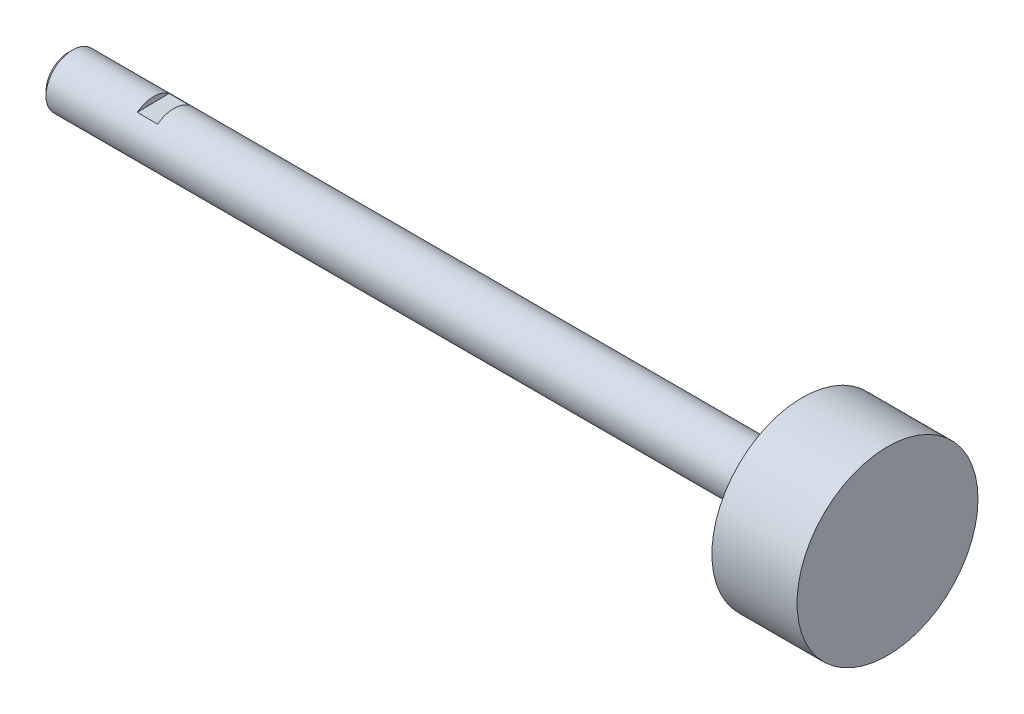
ISO-10303-21;
HEADER;
FILE_DESCRIPTION(('STEP AP214'),'2;1');
FILE_NAME('part.step','',(''),(''),'','','');
FILE_SCHEMA(('AUTOMOTIVE_DESIGN { 1 0 10303 214 1 1 1 1 }'));
ENDSEC;
DATA;
#1=APPLICATION_CONTEXT('core data for automotive mechanical design processes');
#2=APPLICATION_PROTOCOL_DEFINITION('international standard','automotive_design',2000,#1);
#3=PRODUCT_CONTEXT('',#1,'mechanical');
#4=PRODUCT('Part','Part','',(#3));
#5=PRODUCT_RELATED_PRODUCT_CATEGORY('part','',(#4));
#6=PRODUCT_DEFINITION_FORMATION('','',#4);
#7=PRODUCT_DEFINITION_CONTEXT('part definition',#1,'design');
#8=PRODUCT_DEFINITION('design','',#6,#7);
#9=PRODUCT_DEFINITION_SHAPE('','',#8);
#10=(LENGTH_UNIT() NAMED_UNIT(*) SI_UNIT(.MILLI.,.METRE.));
#11=(NAMED_UNIT(*) PLANE_ANGLE_UNIT() SI_UNIT($,.RADIAN.));
#12=(NAMED_UNIT(*) SI_UNIT($,.STERADIAN.) SOLID_ANGLE_UNIT());
#13=UNCERTAINTY_MEASURE_WITH_UNIT(LENGTH_MEASURE(1.E-05),#10,'distance_accuracy_value','');
#14=(GEOMETRIC_REPRESENTATION_CONTEXT(3) GLOBAL_UNCERTAINTY_ASSIGNED_CONTEXT((#13)) GLOBAL_UNIT_ASSIGNED_CONTEXT((#10,
#11,#12)) REPRESENTATION_CONTEXT('',''));
#15=CARTESIAN_POINT('',(0.,0.,0.));
#16=DIRECTION('',(0.,0.,1.));
#17=DIRECTION('',(1.,0.,0.));
#18=AXIS2_PLACEMENT_3D('',#15,#16,#17);
#19=CARTESIAN_POINT('',(788.274608769416,0.,0.));
#20=DIRECTION('',(-1.,0.,0.));
#21=DIRECTION('',(0.,0.,1.));
#22=AXIS2_PLACEMENT_3D('',#19,#20,#21);
#23=PLANE('',#22);
#24=CARTESIAN_POINT('',(788.274608769416,0.,0.));
#25=DIRECTION('',(1.,0.,0.));
#26=DIRECTION('',(0.,0.,-1.));
#27=AXIS2_PLACEMENT_3D('',#24,#25,#26);
#28=CIRCLE('',#27,13.49375);
#29=CARTESIAN_POINT('',(788.274608769416,0.,-13.49375));
#30=VERTEX_POINT('',#29);
#31=EDGE_CURVE('E19',#30,#30,#28,.F.);
#32=ORIENTED_EDGE('',*,*,#31,.F.);
#33=EDGE_LOOP('',(#32));
#34=FACE_BOUND('',#33,.T.);
#35=ADVANCED_FACE('F16',(#34),#23,.F.);
#36=CARTESIAN_POINT('',(775.574608769415,0.,0.));
#37=DIRECTION('',(1.,0.,0.));
#38=DIRECTION('',(0.,0.,-1.));
#39=AXIS2_PLACEMENT_3D('',#36,#37,#38);
#40=CYLINDRICAL_SURFACE('',#39,13.49375);
#41=ORIENTED_EDGE('',*,*,#31,.T.);
#42=EDGE_LOOP('',(#41));
#43=FACE_BOUND('',#42,.T.);
#44=CARTESIAN_POINT('',(775.574608769415,0.,0.));
#45=DIRECTION('',(1.,0.,0.));
#46=DIRECTION('',(0.,0.,-1.));
#47=AXIS2_PLACEMENT_3D('',#44,#45,#46);
#48=CIRCLE('',#47,13.49375);
#49=CARTESIAN_POINT('',(775.574608769415,0.,-13.49375));
#50=VERTEX_POINT('',#49);
#51=EDGE_CURVE('E74',#50,#50,#48,.F.);
#52=ORIENTED_EDGE('',*,*,#51,.F.);
#53=EDGE_LOOP('',(#52));
#54=FACE_BOUND('',#53,.T.);
#55=ADVANCED_FACE('F146',(#43,#54),#40,.T.);
#56=CARTESIAN_POINT('',(678.800608769415,14.005656998368,14.4390416594754));
#57=DIRECTION('',(-1.,0.,0.));
#58=DIRECTION('',(0.,-1.,0.));
#59=AXIS2_PLACEMENT_3D('',#56,#57,#58);
#60=PLANE('',#59);
#61=DIRECTION('',(0.,0.0152342752076542,-0.999883951695844));
#62=VECTOR('',#61,1.);
#63=CARTESIAN_POINT('',(678.800608769415,2.95793921608062,14.270718152706));
#64=LINE('',#63,#62);
#65=CARTESIAN_POINT('',(678.800608769415,3.13851638853715,2.41874526126331));
#66=VERTEX_POINT('',#65);
#67=CARTESIAN_POINT('',(678.800608769415,3.21074670473145,-2.32200761369469));
#68=VERTEX_POINT('',#67);
#69=EDGE_CURVE('E56',#66,#68,#64,.T.);
#70=ORIENTED_EDGE('',*,*,#69,.T.);
#71=CARTESIAN_POINT('',(678.800608769415,0.,0.));
#72=DIRECTION('',(-1.,0.,0.));
#73=DIRECTION('',(0.,0.,1.));
#74=AXIS2_PLACEMENT_3D('',#71,#72,#73);
#75=CIRCLE('',#74,3.9624);
#76=EDGE_CURVE('E54',#66,#68,#75,.T.);
#77=ORIENTED_EDGE('',*,*,#76,.F.);
#78=EDGE_LOOP('',(#70,#77));
#79=FACE_BOUND('',#78,.T.);
#80=ADVANCED_FACE('F58',(#79),#60,.F.);
#81=CARTESIAN_POINT('',(681.848608769415,14.005656998368,14.4390416594754));
#82=DIRECTION('',(1.,0.,0.));
#83=DIRECTION('',(0.,1.,0.));
#84=AXIS2_PLACEMENT_3D('',#81,#82,#83);
#85=PLANE('',#84);
#86=DIRECTION('',(0.,0.0152342752076542,-0.999883951695844));
#87=VECTOR('',#86,1.);
#88=CARTESIAN_POINT('',(681.848608769415,2.95793921608063,14.270718152706));
#89=LINE('',#88,#87);
#90=CARTESIAN_POINT('',(681.848608769415,3.21074670473145,-2.32200761369469));
#91=VERTEX_POINT('',#90);
#92=CARTESIAN_POINT('',(681.848608769415,3.13851638853715,2.41874526126331));
#93=VERTEX_POINT('',#92);
#94=EDGE_CURVE('E62',#91,#93,#89,.F.);
#95=ORIENTED_EDGE('',*,*,#94,.T.);
#96=CARTESIAN_POINT('',(681.848608769415,0.,0.));
#97=DIRECTION('',(-1.,0.,0.));
#98=DIRECTION('',(0.,0.,1.));
#99=AXIS2_PLACEMENT_3D('',#96,#97,#98);
#100=CIRCLE('',#99,3.9624);
#101=EDGE_CURVE('E70',#91,#93,#100,.F.);
#102=ORIENTED_EDGE('',*,*,#101,.F.);
#103=EDGE_LOOP('',(#95,#102));
#104=FACE_BOUND('',#103,.T.);
#105=ADVANCED_FACE('F141',(#104),#85,.F.);
#106=CARTESIAN_POINT('',(678.800608769415,2.95793921608062,14.270718152706));
#107=DIRECTION('',(0.,-0.999883951695844,-0.0152342752076542));
#108=DIRECTION('',(0.,0.0152342752076542,-0.999883951695844));
#109=AXIS2_PLACEMENT_3D('',#106,#107,#108);
#110=PLANE('',#109);
#111=ORIENTED_EDGE('',*,*,#94,.F.);
#112=DIRECTION('',(-1.,0.,0.));
#113=VECTOR('',#112,1.);
#114=CARTESIAN_POINT('',(799.48196840851,3.21074670473146,-2.32200761369467));
#115=LINE('',#114,#113);
#116=EDGE_CURVE('E65',#68,#91,#115,.F.);
#117=ORIENTED_EDGE('',*,*,#116,.F.);
#118=ORIENTED_EDGE('',*,*,#69,.F.);
#119=DIRECTION('',(-1.,0.,0.));
#120=VECTOR('',#119,1.);
#121=CARTESIAN_POINT('',(799.48196840851,3.13851638853715,2.41874526126331));
#122=LINE('',#121,#120);
#123=EDGE_CURVE('E73',#93,#66,#122,.T.);
#124=ORIENTED_EDGE('',*,*,#123,.F.);
#125=EDGE_LOOP('',(#111,#117,#118,#124));
#126=FACE_BOUND('',#125,.T.);
#127=ADVANCED_FACE('F66',(#126),#110,.F.);
#128=CARTESIAN_POINT('',(666.100608769416,0.,0.));
#129=DIRECTION('',(-1.,0.,0.));
#130=DIRECTION('',(0.,0.,1.));
#131=AXIS2_PLACEMENT_3D('',#128,#129,#130);
#132=PLANE('',#131);
#133=CARTESIAN_POINT('',(666.100608769398,0.,0.));
#134=DIRECTION('',(1.,0.,0.));
#135=DIRECTION('',(0.,0.,-1.));
#136=AXIS2_PLACEMENT_3D('',#133,#134,#135);
#137=CIRCLE('',#136,3.32739999998921);
#138=CARTESIAN_POINT('',(666.100608769398,0.,-3.32739999998921));
#139=VERTEX_POINT('',#138);
#140=EDGE_CURVE('E79',#139,#139,#137,.T.);
#141=ORIENTED_EDGE('',*,*,#140,.F.);
#142=EDGE_LOOP('',(#141));
#143=FACE_BOUND('',#142,.T.);
#144=ADVANCED_FACE('F130',(#143),#132,.T.);
#145=CARTESIAN_POINT('',(775.574608769415,0.,0.));
#146=DIRECTION('',(-1.,0.,0.));
#147=DIRECTION('',(0.,0.,1.));
#148=AXIS2_PLACEMENT_3D('',#145,#146,#147);
#149=PLANE('',#148);
#150=ORIENTED_EDGE('',*,*,#51,.T.);
#151=EDGE_LOOP('',(#150));
#152=FACE_BOUND('',#151,.T.);
#153=CARTESIAN_POINT('',(775.574608769415,0.,0.));
#154=DIRECTION('',(-1.,0.,0.));
#155=DIRECTION('',(0.,0.,1.));
#156=AXIS2_PLACEMENT_3D('',#153,#154,#155);
#157=CIRCLE('',#156,3.9624);
#158=CARTESIAN_POINT('',(775.574608769415,0.,3.9624));
#159=VERTEX_POINT('',#158);
#160=EDGE_CURVE('E83',#159,#159,#157,.T.);
#161=ORIENTED_EDGE('',*,*,#160,.F.);
#162=EDGE_LOOP('',(#161));
#163=FACE_BOUND('',#162,.T.);
#164=ADVANCED_FACE('F116',(#152,#163),#149,.T.);
#165=CARTESIAN_POINT('',(666.735608769443,0.,0.));
#166=DIRECTION('',(1.,0.,0.));
#167=DIRECTION('',(0.,0.,-1.));
#168=AXIS2_PLACEMENT_3D('',#165,#166,#167);
#169=CONICAL_SURFACE('',#168,3.96240000003445,0.785398163397448);
#170=CARTESIAN_POINT('',(666.735608769416,0.,0.));
#171=DIRECTION('',(-1.,0.,0.));
#172=DIRECTION('',(0.,0.,1.));
#173=AXIS2_PLACEMENT_3D('',#170,#171,#172);
#174=CIRCLE('',#173,3.9624);
#175=CARTESIAN_POINT('',(666.735608769416,0.,3.9624));
#176=VERTEX_POINT('',#175);
#177=EDGE_CURVE('E86',#176,#176,#174,.F.);
#178=ORIENTED_EDGE('',*,*,#177,.F.);
#179=EDGE_LOOP('',(#178));
#180=FACE_BOUND('',#179,.T.);
#181=ORIENTED_EDGE('',*,*,#140,.T.);
#182=EDGE_LOOP('',(#181));
#183=FACE_BOUND('',#182,.T.);
#184=ADVANCED_FACE('F107',(#180,#183),#169,.T.);
#185=CARTESIAN_POINT('',(678.800608769415,-14.4390416594754,14.005656998368));
#186=DIRECTION('',(-1.,0.,0.));
#187=DIRECTION('',(0.,0.,1.));
#188=AXIS2_PLACEMENT_3D('',#185,#186,#187);
#189=PLANE('',#188);
#190=DIRECTION('',(0.,-0.0152342752076542,0.999883951695844));
#191=VECTOR('',#190,1.);
#192=CARTESIAN_POINT('',(678.800608769415,-3.39132387718799,14.1739805051374));
#193=LINE('',#192,#191);
#194=CARTESIAN_POINT('',(678.800608769415,-3.13851638853719,-2.41874526126326));
#195=VERTEX_POINT('',#194);
#196=CARTESIAN_POINT('',(678.800608769415,-3.21074670473148,2.32200761369465));
#197=VERTEX_POINT('',#196);
#198=EDGE_CURVE('E82',#195,#197,#193,.T.);
#199=ORIENTED_EDGE('',*,*,#198,.T.);
#200=CARTESIAN_POINT('',(678.800608769415,0.,0.));
#201=DIRECTION('',(-1.,0.,0.));
#202=DIRECTION('',(0.,0.,1.));
#203=AXIS2_PLACEMENT_3D('',#200,#201,#202);
#204=CIRCLE('',#203,3.9624);
#205=EDGE_CURVE('E87',#195,#197,#204,.T.);
#206=ORIENTED_EDGE('',*,*,#205,.F.);
#207=EDGE_LOOP('',(#199,#206));
#208=FACE_BOUND('',#207,.T.);
#209=ADVANCED_FACE('F105',(#208),#189,.F.);
#210=CARTESIAN_POINT('',(678.800608769415,-3.39132387718799,14.1739805051374));
#211=DIRECTION('',(0.,0.999883951695844,0.0152342752076542));
#212=DIRECTION('',(0.,-0.0152342752076542,0.999883951695844));
#213=AXIS2_PLACEMENT_3D('',#210,#211,#212);
#214=PLANE('',#213);
#215=DIRECTION('',(0.,-0.0152342752076684,0.999883951695844));
#216=VECTOR('',#215,1.);
#217=CARTESIAN_POINT('',(681.848608769415,-3.13851638853717,-2.4187452612632));
#218=LINE('',#217,#216);
#219=CARTESIAN_POINT('',(681.848608769415,-3.13851638853718,-2.41874526126326));
#220=VERTEX_POINT('',#219);
#221=CARTESIAN_POINT('',(681.848608769415,-3.21074670473152,2.32200761369461));
#222=VERTEX_POINT('',#221);
#223=EDGE_CURVE('E34',#220,#222,#218,.T.);
#224=ORIENTED_EDGE('',*,*,#223,.T.);
#225=DIRECTION('',(-1.,0.,0.));
#226=VECTOR('',#225,1.);
#227=CARTESIAN_POINT('',(799.48196840851,-3.2107467047315,2.32200761369462));
#228=LINE('',#227,#226);
#229=EDGE_CURVE('E25',#197,#222,#228,.F.);
#230=ORIENTED_EDGE('',*,*,#229,.F.);
#231=ORIENTED_EDGE('',*,*,#198,.F.);
#232=DIRECTION('',(-1.,0.,0.));
#233=VECTOR('',#232,1.);
#234=CARTESIAN_POINT('',(799.48196840851,-3.13851638853721,-2.41874526126323));
#235=LINE('',#234,#233);
#236=EDGE_CURVE('E89',#220,#195,#235,.T.);
#237=ORIENTED_EDGE('',*,*,#236,.F.);
#238=EDGE_LOOP('',(#224,#230,#231,#237));
#239=FACE_BOUND('',#238,.T.);
#240=ADVANCED_FACE('F103',(#239),#214,.F.);
#241=CARTESIAN_POINT('',(681.848608769415,-14.4390416594754,14.005656998368));
#242=DIRECTION('',(1.,0.,0.));
#243=DIRECTION('',(0.,1.,0.));
#244=AXIS2_PLACEMENT_3D('',#241,#242,#243);
#245=PLANE('',#244);
#246=ORIENTED_EDGE('',*,*,#223,.F.);
#247=CARTESIAN_POINT('',(681.848608769415,0.,0.));
#248=DIRECTION('',(-1.,0.,0.));
#249=DIRECTION('',(0.,0.,1.));
#250=AXIS2_PLACEMENT_3D('',#247,#248,#249);
#251=CIRCLE('',#250,3.9624);
#252=EDGE_CURVE('E10',#222,#220,#251,.F.);
#253=ORIENTED_EDGE('',*,*,#252,.F.);
#254=EDGE_LOOP('',(#246,#253));
#255=FACE_BOUND('',#254,.T.);
#256=ADVANCED_FACE('F114',(#255),#245,.F.);
#257=CARTESIAN_POINT('',(799.48196840851,0.,0.));
#258=DIRECTION('',(-1.,0.,0.));
#259=DIRECTION('',(0.,0.,1.));
#260=AXIS2_PLACEMENT_3D('',#257,#258,#259);
#261=CYLINDRICAL_SURFACE('',#260,3.9624);
#262=ORIENTED_EDGE('',*,*,#160,.T.);
#263=EDGE_LOOP('',(#262));
#264=FACE_BOUND('',#263,.T.);
#265=ORIENTED_EDGE('',*,*,#229,.T.);
#266=ORIENTED_EDGE('',*,*,#252,.T.);
#267=ORIENTED_EDGE('',*,*,#236,.T.);
#268=ORIENTED_EDGE('',*,*,#205,.T.);
#269=EDGE_LOOP('',(#265,#266,#267,#268));
#270=FACE_BOUND('',#269,.T.);
#271=ORIENTED_EDGE('',*,*,#177,.T.);
#272=EDGE_LOOP('',(#271));
#273=FACE_BOUND('',#272,.T.);
#274=ORIENTED_EDGE('',*,*,#101,.T.);
#275=ORIENTED_EDGE('',*,*,#123,.T.);
#276=ORIENTED_EDGE('',*,*,#76,.T.);
#277=ORIENTED_EDGE('',*,*,#116,.T.);
#278=EDGE_LOOP('',(#274,#275,#276,#277));
#279=FACE_BOUND('',#278,.T.);
#280=ADVANCED_FACE('F72',(#264,#270,#273,#279),#261,.T.);
#281=CLOSED_SHELL('',(#35,#55,#80,#105,#127,#144,#164,#184,#209,#240,#256,#280));
#282=MANIFOLD_SOLID_BREP('B1',#281);
#283=ADVANCED_BREP_SHAPE_REPRESENTATION('',(#18,#282),#14);
#284=SHAPE_DEFINITION_REPRESENTATION(#9,#283);
ENDSEC;
END-ISO-10303-21;
